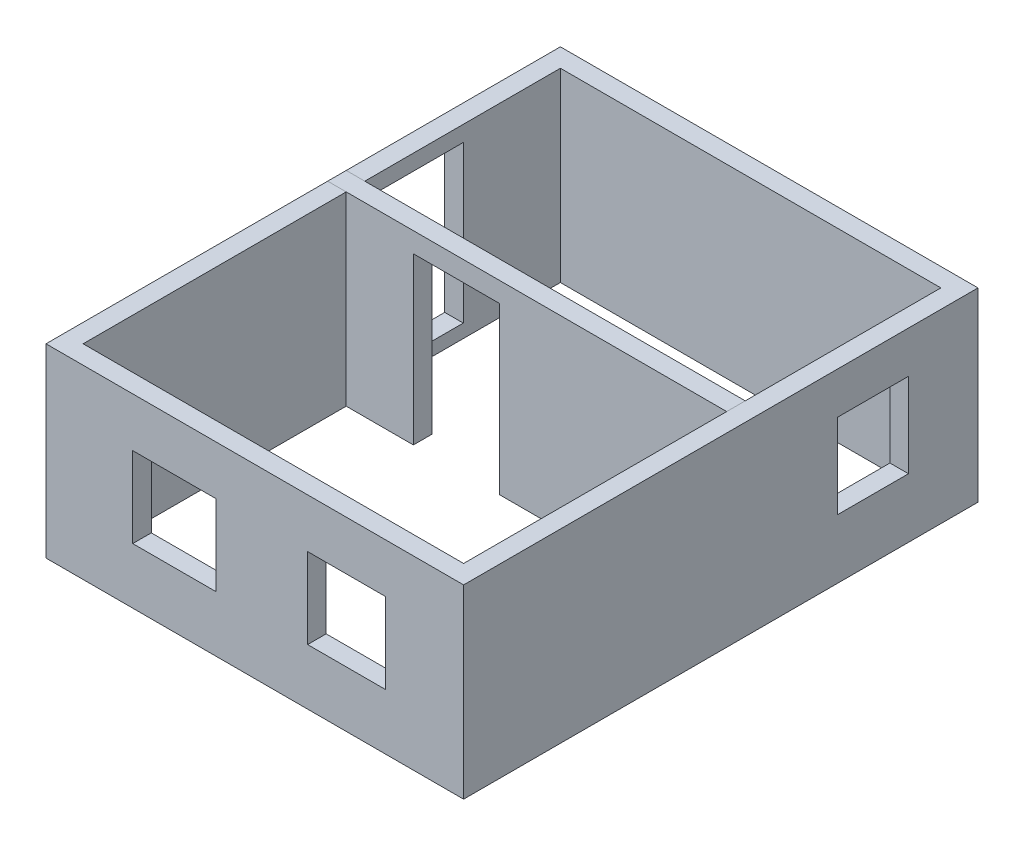
ISO-10303-21;
HEADER;
FILE_DESCRIPTION(('STEP AP214'),'2;1');
FILE_NAME('part.step','',(''),(''),'','','');
FILE_SCHEMA(('AUTOMOTIVE_DESIGN { 1 0 10303 214 1 1 1 1 }'));
ENDSEC;
DATA;
#1=APPLICATION_CONTEXT('core data for automotive mechanical design processes');
#2=APPLICATION_PROTOCOL_DEFINITION('international standard','automotive_design',2000,#1);
#3=PRODUCT_CONTEXT('',#1,'mechanical');
#4=PRODUCT('Part','Part','',(#3));
#5=PRODUCT_RELATED_PRODUCT_CATEGORY('part','',(#4));
#6=PRODUCT_DEFINITION_FORMATION('','',#4);
#7=PRODUCT_DEFINITION_CONTEXT('part definition',#1,'design');
#8=PRODUCT_DEFINITION('design','',#6,#7);
#9=PRODUCT_DEFINITION_SHAPE('','',#8);
#10=(LENGTH_UNIT() NAMED_UNIT(*) SI_UNIT(.MILLI.,.METRE.));
#11=(NAMED_UNIT(*) PLANE_ANGLE_UNIT() SI_UNIT($,.RADIAN.));
#12=(NAMED_UNIT(*) SI_UNIT($,.STERADIAN.) SOLID_ANGLE_UNIT());
#13=UNCERTAINTY_MEASURE_WITH_UNIT(LENGTH_MEASURE(1.E-05),#10,'distance_accuracy_value','');
#14=(GEOMETRIC_REPRESENTATION_CONTEXT(3) GLOBAL_UNCERTAINTY_ASSIGNED_CONTEXT((#13)) GLOBAL_UNIT_ASSIGNED_CONTEXT((#10,
#11,#12)) REPRESENTATION_CONTEXT('',''));
#15=CARTESIAN_POINT('',(0.,0.,0.));
#16=DIRECTION('',(0.,0.,1.));
#17=DIRECTION('',(1.,0.,0.));
#18=AXIS2_PLACEMENT_3D('',#15,#16,#17);
#19=CARTESIAN_POINT('',(4500.,2000.,-5543.));
#20=DIRECTION('',(0.,1.,0.));
#21=DIRECTION('',(0.,0.,1.));
#22=AXIS2_PLACEMENT_3D('',#19,#20,#21);
#23=PLANE('',#22);
#24=DIRECTION('',(0.,0.,-1.));
#25=VECTOR('',#24,1.);
#26=CARTESIAN_POINT('',(4500.,2000.,1.77635683940025E-12));
#27=LINE('',#26,#25);
#28=CARTESIAN_POINT('',(4500.,2000.,1.77635683940025E-12));
#29=VERTEX_POINT('',#28);
#30=CARTESIAN_POINT('',(4500.,2000.,-5543.));
#31=VERTEX_POINT('',#30);
#32=EDGE_CURVE('E394',#29,#31,#27,.T.);
#33=ORIENTED_EDGE('',*,*,#32,.T.);
#34=DIRECTION('',(-1.,0.,0.));
#35=VECTOR('',#34,1.);
#36=CARTESIAN_POINT('',(4500.,2000.,-5543.));
#37=LINE('',#36,#35);
#38=CARTESIAN_POINT('',(0.,2000.,-5543.));
#39=VERTEX_POINT('',#38);
#40=EDGE_CURVE('E397',#31,#39,#37,.T.);
#41=ORIENTED_EDGE('',*,*,#40,.T.);
#42=DIRECTION('',(0.,0.,1.));
#43=VECTOR('',#42,1.);
#44=CARTESIAN_POINT('',(0.,2000.,0.));
#45=LINE('',#44,#43);
#46=CARTESIAN_POINT('',(0.,2000.,0.));
#47=VERTEX_POINT('',#46);
#48=EDGE_CURVE('E400',#39,#47,#45,.T.);
#49=ORIENTED_EDGE('',*,*,#48,.T.);
#50=DIRECTION('',(1.,0.,0.));
#51=VECTOR('',#50,1.);
#52=CARTESIAN_POINT('',(4500.,2000.,1.77635683940025E-12));
#53=LINE('',#52,#51);
#54=EDGE_CURVE('E402',#47,#29,#53,.T.);
#55=ORIENTED_EDGE('',*,*,#54,.T.);
#56=EDGE_LOOP('',(#33,#41,#49,#55));
#57=FACE_BOUND('',#56,.T.);
#58=DIRECTION('',(-1.,0.,0.));
#59=VECTOR('',#58,1.);
#60=CARTESIAN_POINT('',(4500.,2000.,-5343.));
#61=LINE('',#60,#59);
#62=CARTESIAN_POINT('',(4300.,2000.,-5343.));
#63=VERTEX_POINT('',#62);
#64=CARTESIAN_POINT('',(200.,2000.,-5343.));
#65=VERTEX_POINT('',#64);
#66=EDGE_CURVE('E365',#63,#65,#61,.T.);
#67=ORIENTED_EDGE('',*,*,#66,.F.);
#68=DIRECTION('',(0.,0.,-1.));
#69=VECTOR('',#68,1.);
#70=CARTESIAN_POINT('',(4300.,2000.,1.77635683940025E-12));
#71=LINE('',#70,#69);
#72=CARTESIAN_POINT('',(4300.,2000.,-199.999999999998));
#73=VERTEX_POINT('',#72);
#74=EDGE_CURVE('E363',#73,#63,#71,.T.);
#75=ORIENTED_EDGE('',*,*,#74,.F.);
#76=DIRECTION('',(1.,0.,0.));
#77=VECTOR('',#76,1.);
#78=CARTESIAN_POINT('',(4500.,2000.,-199.999999999998));
#79=LINE('',#78,#77);
#80=CARTESIAN_POINT('',(199.999999999999,2000.,-200.));
#81=VERTEX_POINT('',#80);
#82=EDGE_CURVE('E371',#81,#73,#79,.T.);
#83=ORIENTED_EDGE('',*,*,#82,.F.);
#84=DIRECTION('',(0.,0.,1.));
#85=VECTOR('',#84,1.);
#86=CARTESIAN_POINT('',(200.,2000.,0.));
#87=LINE('',#86,#85);
#88=EDGE_CURVE('E368',#65,#81,#87,.T.);
#89=ORIENTED_EDGE('',*,*,#88,.F.);
#90=EDGE_LOOP('',(#67,#75,#83,#89));
#91=FACE_BOUND('',#90,.T.);
#92=ADVANCED_FACE('F68',(#57,#91),#23,.T.);
#93=CARTESIAN_POINT('',(4500.,0.,-5543.));
#94=DIRECTION('',(0.,1.,0.));
#95=DIRECTION('',(0.,0.,1.));
#96=AXIS2_PLACEMENT_3D('',#93,#94,#95);
#97=PLANE('',#96);
#98=DIRECTION('',(0.,0.,-1.));
#99=VECTOR('',#98,1.);
#100=CARTESIAN_POINT('',(4500.,0.,1.77635683940025E-12));
#101=LINE('',#100,#99);
#102=CARTESIAN_POINT('',(4500.,0.,1.77635683940025E-12));
#103=VERTEX_POINT('',#102);
#104=CARTESIAN_POINT('',(4500.,0.,-5543.));
#105=VERTEX_POINT('',#104);
#106=EDGE_CURVE('E393',#103,#105,#101,.T.);
#107=ORIENTED_EDGE('',*,*,#106,.F.);
#108=DIRECTION('',(1.,0.,0.));
#109=VECTOR('',#108,1.);
#110=CARTESIAN_POINT('',(4500.,0.,1.77635683940025E-12));
#111=LINE('',#110,#109);
#112=CARTESIAN_POINT('',(0.,0.,0.));
#113=VERTEX_POINT('',#112);
#114=EDGE_CURVE('E398',#113,#103,#111,.T.);
#115=ORIENTED_EDGE('',*,*,#114,.F.);
#116=DIRECTION('',(0.,0.,1.));
#117=VECTOR('',#116,1.);
#118=CARTESIAN_POINT('',(0.,0.,0.));
#119=LINE('',#118,#117);
#120=CARTESIAN_POINT('',(0.,0.,-5543.));
#121=VERTEX_POINT('',#120);
#122=EDGE_CURVE('E409',#121,#113,#119,.T.);
#123=ORIENTED_EDGE('',*,*,#122,.F.);
#124=DIRECTION('',(-1.,0.,0.));
#125=VECTOR('',#124,1.);
#126=CARTESIAN_POINT('',(4500.,0.,-5543.));
#127=LINE('',#126,#125);
#128=EDGE_CURVE('E407',#105,#121,#127,.T.);
#129=ORIENTED_EDGE('',*,*,#128,.F.);
#130=EDGE_LOOP('',(#107,#115,#123,#129));
#131=FACE_BOUND('',#130,.T.);
#132=DIRECTION('',(0.,0.,-1.));
#133=VECTOR('',#132,1.);
#134=CARTESIAN_POINT('',(4300.,0.,1.77635683940025E-12));
#135=LINE('',#134,#133);
#136=CARTESIAN_POINT('',(4300.,0.,-199.999999999998));
#137=VERTEX_POINT('',#136);
#138=CARTESIAN_POINT('',(4300.,0.,-5343.));
#139=VERTEX_POINT('',#138);
#140=EDGE_CURVE('E362',#137,#139,#135,.T.);
#141=ORIENTED_EDGE('',*,*,#140,.T.);
#142=DIRECTION('',(-1.,0.,0.));
#143=VECTOR('',#142,1.);
#144=CARTESIAN_POINT('',(4500.,0.,-5343.));
#145=LINE('',#144,#143);
#146=CARTESIAN_POINT('',(200.,0.,-5343.));
#147=VERTEX_POINT('',#146);
#148=EDGE_CURVE('E376',#139,#147,#145,.T.);
#149=ORIENTED_EDGE('',*,*,#148,.T.);
#150=DIRECTION('',(0.,0.,1.));
#151=VECTOR('',#150,1.);
#152=CARTESIAN_POINT('',(200.,0.,0.));
#153=LINE('',#152,#151);
#154=CARTESIAN_POINT('',(200.,0.,-200.));
#155=VERTEX_POINT('',#154);
#156=EDGE_CURVE('E379',#147,#155,#153,.T.);
#157=ORIENTED_EDGE('',*,*,#156,.T.);
#158=DIRECTION('',(1.,0.,0.));
#159=VECTOR('',#158,1.);
#160=CARTESIAN_POINT('',(4500.,0.,-199.999999999998));
#161=LINE('',#160,#159);
#162=EDGE_CURVE('E366',#155,#137,#161,.T.);
#163=ORIENTED_EDGE('',*,*,#162,.T.);
#164=EDGE_LOOP('',(#141,#149,#157,#163));
#165=FACE_BOUND('',#164,.T.);
#166=ADVANCED_FACE('F427',(#131,#165),#97,.F.);
#167=CARTESIAN_POINT('',(4500.,2000.,1.77635683940025E-12));
#168=DIRECTION('',(-1.,0.,0.));
#169=DIRECTION('',(0.,0.,1.));
#170=AXIS2_PLACEMENT_3D('',#167,#168,#169);
#171=PLANE('',#170);
#172=DIRECTION('',(0.,1.,0.));
#173=VECTOR('',#172,1.);
#174=CARTESIAN_POINT('',(4500.,1549.68703188642,-4793.88240825894));
#175=LINE('',#174,#173);
#176=CARTESIAN_POINT('',(4500.,640.341483998576,-4793.88240825894));
#177=VERTEX_POINT('',#176);
#178=CARTESIAN_POINT('',(4500.,1549.68703188642,-4793.88240825894));
#179=VERTEX_POINT('',#178);
#180=EDGE_CURVE('E270',#177,#179,#175,.T.);
#181=ORIENTED_EDGE('',*,*,#180,.F.);
#182=DIRECTION('',(0.,0.,-1.));
#183=VECTOR('',#182,1.);
#184=CARTESIAN_POINT('',(4500.,640.341483998576,-4026.96447630534));
#185=LINE('',#184,#183);
#186=CARTESIAN_POINT('',(4500.,640.341483998576,-4026.96447630534));
#187=VERTEX_POINT('',#186);
#188=EDGE_CURVE('E273',#187,#177,#185,.T.);
#189=ORIENTED_EDGE('',*,*,#188,.F.);
#190=DIRECTION('',(0.,-1.,0.));
#191=VECTOR('',#190,1.);
#192=CARTESIAN_POINT('',(4500.,1549.68703188642,-4026.96447630534));
#193=LINE('',#192,#191);
#194=CARTESIAN_POINT('',(4500.,1549.68703188642,-4026.96447630534));
#195=VERTEX_POINT('',#194);
#196=EDGE_CURVE('E266',#195,#187,#193,.T.);
#197=ORIENTED_EDGE('',*,*,#196,.F.);
#198=DIRECTION('',(0.,0.,1.));
#199=VECTOR('',#198,1.);
#200=CARTESIAN_POINT('',(4500.,1549.68703188642,-4026.96447630534));
#201=LINE('',#200,#199);
#202=EDGE_CURVE('E267',#179,#195,#201,.T.);
#203=ORIENTED_EDGE('',*,*,#202,.F.);
#204=EDGE_LOOP('',(#181,#189,#197,#203));
#205=FACE_BOUND('',#204,.T.);
#206=ORIENTED_EDGE('',*,*,#106,.T.);
#207=DIRECTION('',(0.,-1.,0.));
#208=VECTOR('',#207,1.);
#209=CARTESIAN_POINT('',(4500.,2000.,-5543.));
#210=LINE('',#209,#208);
#211=EDGE_CURVE('E13',#31,#105,#210,.T.);
#212=ORIENTED_EDGE('',*,*,#211,.F.);
#213=ORIENTED_EDGE('',*,*,#32,.F.);
#214=DIRECTION('',(0.,-1.,0.));
#215=VECTOR('',#214,1.);
#216=CARTESIAN_POINT('',(4500.,2000.,1.77635683940025E-12));
#217=LINE('',#216,#215);
#218=EDGE_CURVE('E404',#29,#103,#217,.T.);
#219=ORIENTED_EDGE('',*,*,#218,.T.);
#220=EDGE_LOOP('',(#206,#212,#213,#219));
#221=FACE_BOUND('',#220,.T.);
#222=ADVANCED_FACE('F70',(#205,#221),#171,.F.);
#223=CARTESIAN_POINT('',(4500.,2000.,-5543.));
#224=DIRECTION('',(0.,0.,1.));
#225=DIRECTION('',(1.,0.,0.));
#226=AXIS2_PLACEMENT_3D('',#223,#224,#225);
#227=PLANE('',#226);
#228=ORIENTED_EDGE('',*,*,#128,.T.);
#229=DIRECTION('',(0.,-1.,0.));
#230=VECTOR('',#229,1.);
#231=CARTESIAN_POINT('',(0.,2000.,-5543.));
#232=LINE('',#231,#230);
#233=EDGE_CURVE('E76',#39,#121,#232,.T.);
#234=ORIENTED_EDGE('',*,*,#233,.F.);
#235=ORIENTED_EDGE('',*,*,#40,.F.);
#236=ORIENTED_EDGE('',*,*,#211,.T.);
#237=EDGE_LOOP('',(#228,#234,#235,#236));
#238=FACE_BOUND('',#237,.T.);
#239=ADVANCED_FACE('F438',(#238),#227,.F.);
#240=CARTESIAN_POINT('',(0.,2000.,0.));
#241=DIRECTION('',(1.,0.,0.));
#242=DIRECTION('',(0.,0.,-1.));
#243=AXIS2_PLACEMENT_3D('',#240,#241,#242);
#244=PLANE('',#243);
#245=DIRECTION('',(0.,1.,0.));
#246=VECTOR('',#245,1.);
#247=CARTESIAN_POINT('',(0.,1830.68470668906,-3365.89023000623));
#248=LINE('',#247,#246);
#249=CARTESIAN_POINT('',(0.,144.955037982848,-3365.89023000623));
#250=VERTEX_POINT('',#249);
#251=CARTESIAN_POINT('',(0.,1830.68470668906,-3365.89023000623));
#252=VERTEX_POINT('',#251);
#253=EDGE_CURVE('E253',#250,#252,#248,.T.);
#254=ORIENTED_EDGE('',*,*,#253,.F.);
#255=DIRECTION('',(0.,0.,1.));
#256=VECTOR('',#255,1.);
#257=CARTESIAN_POINT('',(0.,144.955037982848,-4296.45198354059));
#258=LINE('',#257,#256);
#259=CARTESIAN_POINT('',(0.,144.955037982848,-4296.45198354059));
#260=VERTEX_POINT('',#259);
#261=EDGE_CURVE('E246',#260,#250,#258,.T.);
#262=ORIENTED_EDGE('',*,*,#261,.F.);
#263=DIRECTION('',(0.,-1.,0.));
#264=VECTOR('',#263,1.);
#265=CARTESIAN_POINT('',(0.,1830.68470668906,-4296.45198354059));
#266=LINE('',#265,#264);
#267=CARTESIAN_POINT('',(0.,1830.68470668906,-4296.45198354059));
#268=VERTEX_POINT('',#267);
#269=EDGE_CURVE('E257',#268,#260,#266,.T.);
#270=ORIENTED_EDGE('',*,*,#269,.F.);
#271=DIRECTION('',(0.,0.,-1.));
#272=VECTOR('',#271,1.);
#273=CARTESIAN_POINT('',(0.,1830.68470668906,-4296.45198354059));
#274=LINE('',#273,#272);
#275=EDGE_CURVE('E83',#252,#268,#274,.T.);
#276=ORIENTED_EDGE('',*,*,#275,.F.);
#277=EDGE_LOOP('',(#254,#262,#270,#276));
#278=FACE_BOUND('',#277,.T.);
#279=ORIENTED_EDGE('',*,*,#122,.T.);
#280=DIRECTION('',(0.,-1.,0.));
#281=VECTOR('',#280,1.);
#282=CARTESIAN_POINT('',(0.,2000.,0.));
#283=LINE('',#282,#281);
#284=EDGE_CURVE('E414',#47,#113,#283,.T.);
#285=ORIENTED_EDGE('',*,*,#284,.F.);
#286=ORIENTED_EDGE('',*,*,#48,.F.);
#287=ORIENTED_EDGE('',*,*,#233,.T.);
#288=EDGE_LOOP('',(#279,#285,#286,#287));
#289=FACE_BOUND('',#288,.T.);
#290=ADVANCED_FACE('F421',(#278,#289),#244,.F.);
#291=CARTESIAN_POINT('',(4500.,2000.,1.77635683940025E-12));
#292=DIRECTION('',(0.,0.,-1.));
#293=DIRECTION('',(-1.,0.,0.));
#294=AXIS2_PLACEMENT_3D('',#291,#292,#293);
#295=PLANE('',#294);
#296=DIRECTION('',(0.,1.,0.));
#297=VECTOR('',#296,1.);
#298=CARTESIAN_POINT('',(3659.79972418191,1470.46468477926,0.));
#299=LINE('',#298,#297);
#300=CARTESIAN_POINT('',(3659.79972418191,602.701516519347,0.));
#301=VERTEX_POINT('',#300);
#302=CARTESIAN_POINT('',(3659.79972418191,1470.46468477926,0.));
#303=VERTEX_POINT('',#302);
#304=EDGE_CURVE('E302',#301,#303,#299,.T.);
#305=ORIENTED_EDGE('',*,*,#304,.F.);
#306=DIRECTION('',(1.,0.,0.));
#307=VECTOR('',#306,1.);
#308=CARTESIAN_POINT('',(2819.15415493012,602.701516519347,0.));
#309=LINE('',#308,#307);
#310=CARTESIAN_POINT('',(2819.15415493012,602.701516519347,0.));
#311=VERTEX_POINT('',#310);
#312=EDGE_CURVE('E305',#311,#301,#309,.T.);
#313=ORIENTED_EDGE('',*,*,#312,.F.);
#314=DIRECTION('',(0.,-1.,0.));
#315=VECTOR('',#314,1.);
#316=CARTESIAN_POINT('',(2819.15415493012,1470.46468477926,0.));
#317=LINE('',#316,#315);
#318=CARTESIAN_POINT('',(2819.15415493012,1470.46468477926,1.11284972542972E-12));
#319=VERTEX_POINT('',#318);
#320=EDGE_CURVE('E298',#319,#311,#317,.T.);
#321=ORIENTED_EDGE('',*,*,#320,.F.);
#322=DIRECTION('',(-1.,0.,0.));
#323=VECTOR('',#322,1.);
#324=CARTESIAN_POINT('',(2819.15415493012,1470.46468477926,0.));
#325=LINE('',#324,#323);
#326=EDGE_CURVE('E299',#303,#319,#325,.T.);
#327=ORIENTED_EDGE('',*,*,#326,.F.);
#328=EDGE_LOOP('',(#305,#313,#321,#327));
#329=FACE_BOUND('',#328,.T.);
#330=DIRECTION('',(0.,1.,0.));
#331=VECTOR('',#330,1.);
#332=CARTESIAN_POINT('',(1829.36179113365,1470.46468477926,0.));
#333=LINE('',#332,#331);
#334=CARTESIAN_POINT('',(1829.36179113365,602.701516519347,0.));
#335=VERTEX_POINT('',#334);
#336=CARTESIAN_POINT('',(1829.36179113365,1470.46468477926,0.));
#337=VERTEX_POINT('',#336);
#338=EDGE_CURVE('E334',#335,#337,#333,.T.);
#339=ORIENTED_EDGE('',*,*,#338,.F.);
#340=DIRECTION('',(1.,0.,0.));
#341=VECTOR('',#340,1.);
#342=CARTESIAN_POINT('',(934.481023865607,602.701516519347,0.));
#343=LINE('',#342,#341);
#344=CARTESIAN_POINT('',(934.481023865607,602.701516519347,0.));
#345=VERTEX_POINT('',#344);
#346=EDGE_CURVE('E337',#345,#335,#343,.T.);
#347=ORIENTED_EDGE('',*,*,#346,.F.);
#348=DIRECTION('',(0.,-1.,0.));
#349=VECTOR('',#348,1.);
#350=CARTESIAN_POINT('',(934.481023865607,1470.46468477926,0.));
#351=LINE('',#350,#349);
#352=CARTESIAN_POINT('',(934.481023865607,1470.46468477926,3.68882612896316E-13));
#353=VERTEX_POINT('',#352);
#354=EDGE_CURVE('E330',#353,#345,#351,.T.);
#355=ORIENTED_EDGE('',*,*,#354,.F.);
#356=DIRECTION('',(-1.,0.,0.));
#357=VECTOR('',#356,1.);
#358=CARTESIAN_POINT('',(934.481023865607,1470.46468477926,0.));
#359=LINE('',#358,#357);
#360=EDGE_CURVE('E331',#337,#353,#359,.T.);
#361=ORIENTED_EDGE('',*,*,#360,.F.);
#362=EDGE_LOOP('',(#339,#347,#355,#361));
#363=FACE_BOUND('',#362,.T.);
#364=ORIENTED_EDGE('',*,*,#114,.T.);
#365=ORIENTED_EDGE('',*,*,#218,.F.);
#366=ORIENTED_EDGE('',*,*,#54,.F.);
#367=ORIENTED_EDGE('',*,*,#284,.T.);
#368=EDGE_LOOP('',(#364,#365,#366,#367));
#369=FACE_BOUND('',#368,.T.);
#370=ADVANCED_FACE('F431',(#329,#363,#369),#295,.F.);
#371=CARTESIAN_POINT('',(4300.,2000.,1.77635683940025E-12));
#372=DIRECTION('',(-1.,0.,0.));
#373=DIRECTION('',(0.,0.,1.));
#374=AXIS2_PLACEMENT_3D('',#371,#372,#373);
#375=PLANE('',#374);
#376=DIRECTION('',(0.,0.,-1.));
#377=VECTOR('',#376,1.);
#378=CARTESIAN_POINT('',(4300.,640.341483998576,-4026.96447630534));
#379=LINE('',#378,#377);
#380=CARTESIAN_POINT('',(4300.,640.341483998576,-4026.96447630534));
#381=VERTEX_POINT('',#380);
#382=CARTESIAN_POINT('',(4300.,640.341483998576,-4793.88240825894));
#383=VERTEX_POINT('',#382);
#384=EDGE_CURVE('E269',#381,#383,#379,.T.);
#385=ORIENTED_EDGE('',*,*,#384,.T.);
#386=DIRECTION('',(0.,1.,0.));
#387=VECTOR('',#386,1.);
#388=CARTESIAN_POINT('',(4300.,1549.68703188642,-4793.88240825894));
#389=LINE('',#388,#387);
#390=CARTESIAN_POINT('',(4300.,1549.68703188642,-4793.88240825894));
#391=VERTEX_POINT('',#390);
#392=EDGE_CURVE('E290',#383,#391,#389,.T.);
#393=ORIENTED_EDGE('',*,*,#392,.T.);
#394=DIRECTION('',(0.,0.,1.));
#395=VECTOR('',#394,1.);
#396=CARTESIAN_POINT('',(4300.,1549.68703188642,-4026.96447630534));
#397=LINE('',#396,#395);
#398=CARTESIAN_POINT('',(4300.,1549.68703188642,-4026.96447630534));
#399=VERTEX_POINT('',#398);
#400=EDGE_CURVE('E286',#391,#399,#397,.T.);
#401=ORIENTED_EDGE('',*,*,#400,.T.);
#402=DIRECTION('',(0.,-1.,0.));
#403=VECTOR('',#402,1.);
#404=CARTESIAN_POINT('',(4300.,1549.68703188642,-4026.96447630534));
#405=LINE('',#404,#403);
#406=EDGE_CURVE('E281',#399,#381,#405,.T.);
#407=ORIENTED_EDGE('',*,*,#406,.T.);
#408=EDGE_LOOP('',(#385,#393,#401,#407));
#409=FACE_BOUND('',#408,.T.);
#410=ORIENTED_EDGE('',*,*,#140,.F.);
#411=DIRECTION('',(0.,-1.,0.));
#412=VECTOR('',#411,1.);
#413=CARTESIAN_POINT('',(4300.,2000.,-199.999999999998));
#414=LINE('',#413,#412);
#415=EDGE_CURVE('E373',#73,#137,#414,.T.);
#416=ORIENTED_EDGE('',*,*,#415,.F.);
#417=ORIENTED_EDGE('',*,*,#74,.T.);
#418=DIRECTION('',(0.,-1.,0.));
#419=VECTOR('',#418,1.);
#420=CARTESIAN_POINT('',(4300.,2000.,-5343.));
#421=LINE('',#420,#419);
#422=EDGE_CURVE('E390',#63,#139,#421,.T.);
#423=ORIENTED_EDGE('',*,*,#422,.T.);
#424=EDGE_LOOP('',(#410,#416,#417,#423));
#425=FACE_BOUND('',#424,.T.);
#426=ADVANCED_FACE('F454',(#409,#425),#375,.T.);
#427=CARTESIAN_POINT('',(4500.,2000.,-5343.));
#428=DIRECTION('',(0.,0.,1.));
#429=DIRECTION('',(1.,0.,0.));
#430=AXIS2_PLACEMENT_3D('',#427,#428,#429);
#431=PLANE('',#430);
#432=ORIENTED_EDGE('',*,*,#148,.F.);
#433=ORIENTED_EDGE('',*,*,#422,.F.);
#434=ORIENTED_EDGE('',*,*,#66,.T.);
#435=DIRECTION('',(0.,-1.,0.));
#436=VECTOR('',#435,1.);
#437=CARTESIAN_POINT('',(200.,2000.,-5343.));
#438=LINE('',#437,#436);
#439=EDGE_CURVE('E388',#65,#147,#438,.T.);
#440=ORIENTED_EDGE('',*,*,#439,.T.);
#441=EDGE_LOOP('',(#432,#433,#434,#440));
#442=FACE_BOUND('',#441,.T.);
#443=ADVANCED_FACE('F462',(#442),#431,.T.);
#444=CARTESIAN_POINT('',(200.,2000.,0.));
#445=DIRECTION('',(1.,0.,0.));
#446=DIRECTION('',(0.,0.,-1.));
#447=AXIS2_PLACEMENT_3D('',#444,#445,#446);
#448=PLANE('',#447);
#449=DIRECTION('',(0.,0.,1.));
#450=VECTOR('',#449,1.);
#451=CARTESIAN_POINT('',(200.,144.955037982848,-4296.45198354059));
#452=LINE('',#451,#450);
#453=CARTESIAN_POINT('',(200.,144.955037982847,-4296.45198354059));
#454=VERTEX_POINT('',#453);
#455=CARTESIAN_POINT('',(200.,144.955037982848,-3365.89023000623));
#456=VERTEX_POINT('',#455);
#457=EDGE_CURVE('E243',#454,#456,#452,.T.);
#458=ORIENTED_EDGE('',*,*,#457,.T.);
#459=DIRECTION('',(0.,1.,0.));
#460=VECTOR('',#459,1.);
#461=CARTESIAN_POINT('',(200.,1830.68470668906,-3365.89023000623));
#462=LINE('',#461,#460);
#463=CARTESIAN_POINT('',(200.,1830.68470668906,-3365.89023000623));
#464=VERTEX_POINT('',#463);
#465=EDGE_CURVE('E230',#456,#464,#462,.T.);
#466=ORIENTED_EDGE('',*,*,#465,.T.);
#467=DIRECTION('',(0.,0.,-1.));
#468=VECTOR('',#467,1.);
#469=CARTESIAN_POINT('',(200.,1830.68470668906,-4296.45198354059));
#470=LINE('',#469,#468);
#471=CARTESIAN_POINT('',(200.,1830.68470668906,-4296.45198354059));
#472=VERTEX_POINT('',#471);
#473=EDGE_CURVE('E261',#464,#472,#470,.T.);
#474=ORIENTED_EDGE('',*,*,#473,.T.);
#475=DIRECTION('',(0.,-1.,0.));
#476=VECTOR('',#475,1.);
#477=CARTESIAN_POINT('',(200.,1830.68470668906,-4296.45198354059));
#478=LINE('',#477,#476);
#479=EDGE_CURVE('E251',#472,#454,#478,.T.);
#480=ORIENTED_EDGE('',*,*,#479,.T.);
#481=EDGE_LOOP('',(#458,#466,#474,#480));
#482=FACE_BOUND('',#481,.T.);
#483=ORIENTED_EDGE('',*,*,#156,.F.);
#484=ORIENTED_EDGE('',*,*,#439,.F.);
#485=ORIENTED_EDGE('',*,*,#88,.T.);
#486=DIRECTION('',(0.,-1.,0.));
#487=VECTOR('',#486,1.);
#488=CARTESIAN_POINT('',(200.,2000.,-200.));
#489=LINE('',#488,#487);
#490=EDGE_CURVE('E386',#81,#155,#489,.T.);
#491=ORIENTED_EDGE('',*,*,#490,.T.);
#492=EDGE_LOOP('',(#483,#484,#485,#491));
#493=FACE_BOUND('',#492,.T.);
#494=ADVANCED_FACE('F249',(#482,#493),#448,.T.);
#495=CARTESIAN_POINT('',(4500.,2000.,-199.999999999998));
#496=DIRECTION('',(0.,0.,-1.));
#497=DIRECTION('',(-1.,0.,0.));
#498=AXIS2_PLACEMENT_3D('',#495,#496,#497);
#499=PLANE('',#498);
#500=DIRECTION('',(1.,0.,0.));
#501=VECTOR('',#500,1.);
#502=CARTESIAN_POINT('',(2819.15415493011,602.701516519347,-199.999999999999));
#503=LINE('',#502,#501);
#504=CARTESIAN_POINT('',(2819.15415493012,602.701516519347,-199.999999999999));
#505=VERTEX_POINT('',#504);
#506=CARTESIAN_POINT('',(3659.79972418191,602.701516519347,-199.999999999999));
#507=VERTEX_POINT('',#506);
#508=EDGE_CURVE('E301',#505,#507,#503,.T.);
#509=ORIENTED_EDGE('',*,*,#508,.T.);
#510=DIRECTION('',(0.,1.,0.));
#511=VECTOR('',#510,1.);
#512=CARTESIAN_POINT('',(3659.79972418191,1470.46468477926,-199.999999999998));
#513=LINE('',#512,#511);
#514=CARTESIAN_POINT('',(3659.79972418191,1470.46468477926,-199.999999999998));
#515=VERTEX_POINT('',#514);
#516=EDGE_CURVE('E322',#507,#515,#513,.T.);
#517=ORIENTED_EDGE('',*,*,#516,.T.);
#518=DIRECTION('',(-1.,0.,0.));
#519=VECTOR('',#518,1.);
#520=CARTESIAN_POINT('',(2819.15415493011,1470.46468477926,-199.999999999999));
#521=LINE('',#520,#519);
#522=CARTESIAN_POINT('',(2819.15415493012,1470.46468477926,-199.999999999999));
#523=VERTEX_POINT('',#522);
#524=EDGE_CURVE('E318',#515,#523,#521,.T.);
#525=ORIENTED_EDGE('',*,*,#524,.T.);
#526=DIRECTION('',(0.,-1.,0.));
#527=VECTOR('',#526,1.);
#528=CARTESIAN_POINT('',(2819.15415493012,1470.46468477926,-199.999999999999));
#529=LINE('',#528,#527);
#530=EDGE_CURVE('E313',#523,#505,#529,.T.);
#531=ORIENTED_EDGE('',*,*,#530,.T.);
#532=EDGE_LOOP('',(#509,#517,#525,#531));
#533=FACE_BOUND('',#532,.T.);
#534=DIRECTION('',(1.,0.,0.));
#535=VECTOR('',#534,1.);
#536=CARTESIAN_POINT('',(934.481023865607,602.701516519347,-200.));
#537=LINE('',#536,#535);
#538=CARTESIAN_POINT('',(934.481023865607,602.701516519347,-200.));
#539=VERTEX_POINT('',#538);
#540=CARTESIAN_POINT('',(1829.36179113365,602.701516519347,-199.999999999999));
#541=VERTEX_POINT('',#540);
#542=EDGE_CURVE('E333',#539,#541,#537,.T.);
#543=ORIENTED_EDGE('',*,*,#542,.T.);
#544=DIRECTION('',(0.,1.,0.));
#545=VECTOR('',#544,1.);
#546=CARTESIAN_POINT('',(1829.36179113365,1470.46468477926,-199.999999999999));
#547=LINE('',#546,#545);
#548=CARTESIAN_POINT('',(1829.36179113365,1470.46468477926,-199.999999999999));
#549=VERTEX_POINT('',#548);
#550=EDGE_CURVE('E354',#541,#549,#547,.T.);
#551=ORIENTED_EDGE('',*,*,#550,.T.);
#552=DIRECTION('',(-1.,0.,0.));
#553=VECTOR('',#552,1.);
#554=CARTESIAN_POINT('',(934.481023865607,1470.46468477926,-200.));
#555=LINE('',#554,#553);
#556=CARTESIAN_POINT('',(934.481023865607,1470.46468477926,-200.));
#557=VERTEX_POINT('',#556);
#558=EDGE_CURVE('E350',#549,#557,#555,.T.);
#559=ORIENTED_EDGE('',*,*,#558,.T.);
#560=DIRECTION('',(0.,-1.,0.));
#561=VECTOR('',#560,1.);
#562=CARTESIAN_POINT('',(934.481023865607,1470.46468477926,-200.));
#563=LINE('',#562,#561);
#564=EDGE_CURVE('E345',#557,#539,#563,.T.);
#565=ORIENTED_EDGE('',*,*,#564,.T.);
#566=EDGE_LOOP('',(#543,#551,#559,#565));
#567=FACE_BOUND('',#566,.T.);
#568=ORIENTED_EDGE('',*,*,#162,.F.);
#569=ORIENTED_EDGE('',*,*,#490,.F.);
#570=ORIENTED_EDGE('',*,*,#82,.T.);
#571=ORIENTED_EDGE('',*,*,#415,.T.);
#572=EDGE_LOOP('',(#568,#569,#570,#571));
#573=FACE_BOUND('',#572,.T.);
#574=ADVANCED_FACE('F485',(#533,#567,#573),#499,.T.);
#575=CARTESIAN_POINT('',(934.481023865607,602.701516519347,-1446.52497119581));
#576=DIRECTION('',(0.,-1.,0.));
#577=DIRECTION('',(0.,0.,-1.));
#578=AXIS2_PLACEMENT_3D('',#575,#576,#577);
#579=PLANE('',#578);
#580=DIRECTION('',(0.,0.,1.));
#581=VECTOR('',#580,1.);
#582=CARTESIAN_POINT('',(934.481023865607,602.701516519347,-1446.52497119581));
#583=LINE('',#582,#581);
#584=EDGE_CURVE('E348',#539,#345,#583,.T.);
#585=ORIENTED_EDGE('',*,*,#584,.T.);
#586=ORIENTED_EDGE('',*,*,#346,.T.);
#587=DIRECTION('',(0.,0.,1.));
#588=VECTOR('',#587,1.);
#589=CARTESIAN_POINT('',(1829.36179113365,602.701516519347,-1446.52497119581));
#590=LINE('',#589,#588);
#591=EDGE_CURVE('E344',#541,#335,#590,.T.);
#592=ORIENTED_EDGE('',*,*,#591,.F.);
#593=ORIENTED_EDGE('',*,*,#542,.F.);
#594=EDGE_LOOP('',(#585,#586,#592,#593));
#595=FACE_BOUND('',#594,.T.);
#596=ADVANCED_FACE('F478',(#595),#579,.F.);
#597=CARTESIAN_POINT('',(1829.36179113365,1470.46468477926,-1446.52497119581));
#598=DIRECTION('',(1.,0.,0.));
#599=DIRECTION('',(0.,0.,-1.));
#600=AXIS2_PLACEMENT_3D('',#597,#598,#599);
#601=PLANE('',#600);
#602=ORIENTED_EDGE('',*,*,#591,.T.);
#603=ORIENTED_EDGE('',*,*,#338,.T.);
#604=DIRECTION('',(0.,0.,1.));
#605=VECTOR('',#604,1.);
#606=CARTESIAN_POINT('',(1829.36179113365,1470.46468477926,-1446.52497119581));
#607=LINE('',#606,#605);
#608=EDGE_CURVE('E353',#549,#337,#607,.T.);
#609=ORIENTED_EDGE('',*,*,#608,.F.);
#610=ORIENTED_EDGE('',*,*,#550,.F.);
#611=EDGE_LOOP('',(#602,#603,#609,#610));
#612=FACE_BOUND('',#611,.T.);
#613=ADVANCED_FACE('F474',(#612),#601,.F.);
#614=CARTESIAN_POINT('',(934.481023865607,1470.46468477926,-1446.52497119581));
#615=DIRECTION('',(0.,1.,0.));
#616=DIRECTION('',(0.,0.,1.));
#617=AXIS2_PLACEMENT_3D('',#614,#615,#616);
#618=PLANE('',#617);
#619=ORIENTED_EDGE('',*,*,#608,.T.);
#620=ORIENTED_EDGE('',*,*,#360,.T.);
#621=DIRECTION('',(0.,0.,1.));
#622=VECTOR('',#621,1.);
#623=CARTESIAN_POINT('',(934.481023865607,1470.46468477926,-1446.52497119581));
#624=LINE('',#623,#622);
#625=EDGE_CURVE('E349',#557,#353,#624,.T.);
#626=ORIENTED_EDGE('',*,*,#625,.F.);
#627=ORIENTED_EDGE('',*,*,#558,.F.);
#628=EDGE_LOOP('',(#619,#620,#626,#627));
#629=FACE_BOUND('',#628,.T.);
#630=ADVANCED_FACE('F483',(#629),#618,.F.);
#631=CARTESIAN_POINT('',(934.481023865607,1470.46468477926,-1446.52497119581));
#632=DIRECTION('',(-1.,0.,0.));
#633=DIRECTION('',(0.,0.,1.));
#634=AXIS2_PLACEMENT_3D('',#631,#632,#633);
#635=PLANE('',#634);
#636=ORIENTED_EDGE('',*,*,#625,.T.);
#637=ORIENTED_EDGE('',*,*,#354,.T.);
#638=ORIENTED_EDGE('',*,*,#584,.F.);
#639=ORIENTED_EDGE('',*,*,#564,.F.);
#640=EDGE_LOOP('',(#636,#637,#638,#639));
#641=FACE_BOUND('',#640,.T.);
#642=ADVANCED_FACE('F480',(#641),#635,.F.);
#643=CARTESIAN_POINT('',(2819.15415493012,602.701516519347,-1446.52497119581));
#644=DIRECTION('',(0.,-1.,0.));
#645=DIRECTION('',(0.,0.,-1.));
#646=AXIS2_PLACEMENT_3D('',#643,#644,#645);
#647=PLANE('',#646);
#648=DIRECTION('',(0.,0.,1.));
#649=VECTOR('',#648,1.);
#650=CARTESIAN_POINT('',(2819.15415493012,602.701516519347,-1446.52497119581));
#651=LINE('',#650,#649);
#652=EDGE_CURVE('E316',#505,#311,#651,.T.);
#653=ORIENTED_EDGE('',*,*,#652,.T.);
#654=ORIENTED_EDGE('',*,*,#312,.T.);
#655=DIRECTION('',(0.,0.,1.));
#656=VECTOR('',#655,1.);
#657=CARTESIAN_POINT('',(3659.79972418191,602.701516519347,-1446.52497119581));
#658=LINE('',#657,#656);
#659=EDGE_CURVE('E312',#507,#301,#658,.T.);
#660=ORIENTED_EDGE('',*,*,#659,.F.);
#661=ORIENTED_EDGE('',*,*,#508,.F.);
#662=EDGE_LOOP('',(#653,#654,#660,#661));
#663=FACE_BOUND('',#662,.T.);
#664=ADVANCED_FACE('F515',(#663),#647,.F.);
#665=CARTESIAN_POINT('',(3659.79972418191,1470.46468477926,-1446.52497119581));
#666=DIRECTION('',(1.,0.,0.));
#667=DIRECTION('',(0.,0.,-1.));
#668=AXIS2_PLACEMENT_3D('',#665,#666,#667);
#669=PLANE('',#668);
#670=ORIENTED_EDGE('',*,*,#659,.T.);
#671=ORIENTED_EDGE('',*,*,#304,.T.);
#672=DIRECTION('',(0.,0.,1.));
#673=VECTOR('',#672,1.);
#674=CARTESIAN_POINT('',(3659.79972418191,1470.46468477926,-1446.52497119581));
#675=LINE('',#674,#673);
#676=EDGE_CURVE('E321',#515,#303,#675,.T.);
#677=ORIENTED_EDGE('',*,*,#676,.F.);
#678=ORIENTED_EDGE('',*,*,#516,.F.);
#679=EDGE_LOOP('',(#670,#671,#677,#678));
#680=FACE_BOUND('',#679,.T.);
#681=ADVANCED_FACE('F518',(#680),#669,.F.);
#682=CARTESIAN_POINT('',(2819.15415493012,1470.46468477926,-1446.52497119581));
#683=DIRECTION('',(0.,1.,0.));
#684=DIRECTION('',(0.,0.,1.));
#685=AXIS2_PLACEMENT_3D('',#682,#683,#684);
#686=PLANE('',#685);
#687=ORIENTED_EDGE('',*,*,#676,.T.);
#688=ORIENTED_EDGE('',*,*,#326,.T.);
#689=DIRECTION('',(0.,0.,1.));
#690=VECTOR('',#689,1.);
#691=CARTESIAN_POINT('',(2819.15415493012,1470.46468477926,-1446.52497119581));
#692=LINE('',#691,#690);
#693=EDGE_CURVE('E317',#523,#319,#692,.T.);
#694=ORIENTED_EDGE('',*,*,#693,.F.);
#695=ORIENTED_EDGE('',*,*,#524,.F.);
#696=EDGE_LOOP('',(#687,#688,#694,#695));
#697=FACE_BOUND('',#696,.T.);
#698=ADVANCED_FACE('F522',(#697),#686,.F.);
#699=CARTESIAN_POINT('',(2819.15415493012,1470.46468477926,-1446.52497119581));
#700=DIRECTION('',(-1.,0.,0.));
#701=DIRECTION('',(0.,0.,1.));
#702=AXIS2_PLACEMENT_3D('',#699,#700,#701);
#703=PLANE('',#702);
#704=ORIENTED_EDGE('',*,*,#693,.T.);
#705=ORIENTED_EDGE('',*,*,#320,.T.);
#706=ORIENTED_EDGE('',*,*,#652,.F.);
#707=ORIENTED_EDGE('',*,*,#530,.F.);
#708=EDGE_LOOP('',(#704,#705,#706,#707));
#709=FACE_BOUND('',#708,.T.);
#710=ADVANCED_FACE('F526',(#709),#703,.F.);
#711=CARTESIAN_POINT('',(3110.43182632712,640.341483998576,-4026.96447630534));
#712=DIRECTION('',(0.,-1.,0.));
#713=DIRECTION('',(0.,0.,-1.));
#714=AXIS2_PLACEMENT_3D('',#711,#712,#713);
#715=PLANE('',#714);
#716=DIRECTION('',(1.,0.,0.));
#717=VECTOR('',#716,1.);
#718=CARTESIAN_POINT('',(3110.43182632712,640.341483998576,-4026.96447630534));
#719=LINE('',#718,#717);
#720=EDGE_CURVE('E284',#381,#187,#719,.T.);
#721=ORIENTED_EDGE('',*,*,#720,.T.);
#722=ORIENTED_EDGE('',*,*,#188,.T.);
#723=DIRECTION('',(1.,0.,0.));
#724=VECTOR('',#723,1.);
#725=CARTESIAN_POINT('',(3110.43182632712,640.341483998576,-4793.88240825894));
#726=LINE('',#725,#724);
#727=EDGE_CURVE('E280',#383,#177,#726,.T.);
#728=ORIENTED_EDGE('',*,*,#727,.F.);
#729=ORIENTED_EDGE('',*,*,#384,.F.);
#730=EDGE_LOOP('',(#721,#722,#728,#729));
#731=FACE_BOUND('',#730,.T.);
#732=ADVANCED_FACE('F530',(#731),#715,.F.);
#733=CARTESIAN_POINT('',(3110.43182632712,1549.68703188642,-4793.88240825894));
#734=DIRECTION('',(0.,0.,-1.));
#735=DIRECTION('',(-1.,0.,0.));
#736=AXIS2_PLACEMENT_3D('',#733,#734,#735);
#737=PLANE('',#736);
#738=ORIENTED_EDGE('',*,*,#727,.T.);
#739=ORIENTED_EDGE('',*,*,#180,.T.);
#740=DIRECTION('',(1.,0.,0.));
#741=VECTOR('',#740,1.);
#742=CARTESIAN_POINT('',(3110.43182632712,1549.68703188642,-4793.88240825894));
#743=LINE('',#742,#741);
#744=EDGE_CURVE('E289',#391,#179,#743,.T.);
#745=ORIENTED_EDGE('',*,*,#744,.F.);
#746=ORIENTED_EDGE('',*,*,#392,.F.);
#747=EDGE_LOOP('',(#738,#739,#745,#746));
#748=FACE_BOUND('',#747,.T.);
#749=ADVANCED_FACE('F534',(#748),#737,.F.);
#750=CARTESIAN_POINT('',(3110.43182632712,1549.68703188642,-4026.96447630534));
#751=DIRECTION('',(0.,1.,0.));
#752=DIRECTION('',(0.,0.,1.));
#753=AXIS2_PLACEMENT_3D('',#750,#751,#752);
#754=PLANE('',#753);
#755=ORIENTED_EDGE('',*,*,#744,.T.);
#756=ORIENTED_EDGE('',*,*,#202,.T.);
#757=DIRECTION('',(1.,0.,0.));
#758=VECTOR('',#757,1.);
#759=CARTESIAN_POINT('',(3110.43182632712,1549.68703188642,-4026.96447630534));
#760=LINE('',#759,#758);
#761=EDGE_CURVE('E285',#399,#195,#760,.T.);
#762=ORIENTED_EDGE('',*,*,#761,.F.);
#763=ORIENTED_EDGE('',*,*,#400,.F.);
#764=EDGE_LOOP('',(#755,#756,#762,#763));
#765=FACE_BOUND('',#764,.T.);
#766=ADVANCED_FACE('F538',(#765),#754,.F.);
#767=CARTESIAN_POINT('',(3110.43182632712,1549.68703188642,-4026.96447630534));
#768=DIRECTION('',(0.,0.,1.));
#769=DIRECTION('',(1.,0.,0.));
#770=AXIS2_PLACEMENT_3D('',#767,#768,#769);
#771=PLANE('',#770);
#772=ORIENTED_EDGE('',*,*,#761,.T.);
#773=ORIENTED_EDGE('',*,*,#196,.T.);
#774=ORIENTED_EDGE('',*,*,#720,.F.);
#775=ORIENTED_EDGE('',*,*,#406,.F.);
#776=EDGE_LOOP('',(#772,#773,#774,#775));
#777=FACE_BOUND('',#776,.T.);
#778=ADVANCED_FACE('F542',(#777),#771,.F.);
#779=CARTESIAN_POINT('',(2125.52062910198,144.955037982848,-4296.45198354059));
#780=DIRECTION('',(0.,-1.,0.));
#781=DIRECTION('',(0.,0.,-1.));
#782=AXIS2_PLACEMENT_3D('',#779,#780,#781);
#783=PLANE('',#782);
#784=DIRECTION('',(-1.,0.,0.));
#785=VECTOR('',#784,1.);
#786=CARTESIAN_POINT('',(2125.52062910198,144.955037982848,-4296.45198354059));
#787=LINE('',#786,#785);
#788=EDGE_CURVE('E91',#454,#260,#787,.T.);
#789=ORIENTED_EDGE('',*,*,#788,.T.);
#790=ORIENTED_EDGE('',*,*,#261,.T.);
#791=DIRECTION('',(-1.,0.,0.));
#792=VECTOR('',#791,1.);
#793=CARTESIAN_POINT('',(2125.52062910198,144.955037982848,-3365.89023000623));
#794=LINE('',#793,#792);
#795=EDGE_CURVE('E234',#456,#250,#794,.T.);
#796=ORIENTED_EDGE('',*,*,#795,.F.);
#797=ORIENTED_EDGE('',*,*,#457,.F.);
#798=EDGE_LOOP('',(#789,#790,#796,#797));
#799=FACE_BOUND('',#798,.T.);
#800=ADVANCED_FACE('F242',(#799),#783,.F.);
#801=CARTESIAN_POINT('',(2125.52062910198,1830.68470668906,-3365.89023000623));
#802=DIRECTION('',(0.,0.,1.));
#803=DIRECTION('',(1.,0.,0.));
#804=AXIS2_PLACEMENT_3D('',#801,#802,#803);
#805=PLANE('',#804);
#806=ORIENTED_EDGE('',*,*,#795,.T.);
#807=ORIENTED_EDGE('',*,*,#253,.T.);
#808=DIRECTION('',(-1.,0.,0.));
#809=VECTOR('',#808,1.);
#810=CARTESIAN_POINT('',(2125.52062910198,1830.68470668906,-3365.89023000623));
#811=LINE('',#810,#809);
#812=EDGE_CURVE('E236',#464,#252,#811,.T.);
#813=ORIENTED_EDGE('',*,*,#812,.F.);
#814=ORIENTED_EDGE('',*,*,#465,.F.);
#815=EDGE_LOOP('',(#806,#807,#813,#814));
#816=FACE_BOUND('',#815,.T.);
#817=ADVANCED_FACE('F232',(#816),#805,.F.);
#818=CARTESIAN_POINT('',(2125.52062910198,1830.68470668906,-4296.45198354059));
#819=DIRECTION('',(0.,1.,0.));
#820=DIRECTION('',(0.,0.,1.));
#821=AXIS2_PLACEMENT_3D('',#818,#819,#820);
#822=PLANE('',#821);
#823=ORIENTED_EDGE('',*,*,#812,.T.);
#824=ORIENTED_EDGE('',*,*,#275,.T.);
#825=DIRECTION('',(-1.,0.,0.));
#826=VECTOR('',#825,1.);
#827=CARTESIAN_POINT('',(2125.52062910198,1830.68470668906,-4296.45198354059));
#828=LINE('',#827,#826);
#829=EDGE_CURVE('E260',#472,#268,#828,.T.);
#830=ORIENTED_EDGE('',*,*,#829,.F.);
#831=ORIENTED_EDGE('',*,*,#473,.F.);
#832=EDGE_LOOP('',(#823,#824,#830,#831));
#833=FACE_BOUND('',#832,.T.);
#834=ADVANCED_FACE('F551',(#833),#822,.F.);
#835=CARTESIAN_POINT('',(2125.52062910198,1830.68470668906,-4296.45198354059));
#836=DIRECTION('',(0.,0.,-1.));
#837=DIRECTION('',(-1.,0.,0.));
#838=AXIS2_PLACEMENT_3D('',#835,#836,#837);
#839=PLANE('',#838);
#840=ORIENTED_EDGE('',*,*,#829,.T.);
#841=ORIENTED_EDGE('',*,*,#269,.T.);
#842=ORIENTED_EDGE('',*,*,#788,.F.);
#843=ORIENTED_EDGE('',*,*,#479,.F.);
#844=EDGE_LOOP('',(#840,#841,#842,#843));
#845=FACE_BOUND('',#844,.T.);
#846=ADVANCED_FACE('F554',(#845),#839,.F.);
#847=CLOSED_SHELL('',(#92,#166,#222,#239,#290,#370,#426,#443,#494,#574,#596,#613,#630,#642,#664,
#681,#698,#710,#732,#749,#766,#778,#800,#817,#834,#846));
#848=MANIFOLD_SOLID_BREP('B2',#847);
#849=CARTESIAN_POINT('',(0.,0.,-3235.04427192938));
#850=DIRECTION('',(0.,-1.,0.));
#851=DIRECTION('',(1.,0.,0.));
#852=AXIS2_PLACEMENT_3D('',#849,#850,#851);
#853=PLANE('',#852);
#854=DIRECTION('',(0.,0.,1.));
#855=VECTOR('',#854,1.);
#856=CARTESIAN_POINT('',(923.490163114547,0.,-5245.73753121941));
#857=LINE('',#856,#855);
#858=CARTESIAN_POINT('',(923.490163114547,0.,-3235.04427192938));
#859=VERTEX_POINT('',#858);
#860=CARTESIAN_POINT('',(923.490163114547,0.,-3035.04427192938));
#861=VERTEX_POINT('',#860);
#862=EDGE_CURVE('E798',#859,#861,#857,.T.);
#863=ORIENTED_EDGE('',*,*,#862,.T.);
#864=DIRECTION('',(-1.,0.,0.));
#865=VECTOR('',#864,1.);
#866=CARTESIAN_POINT('',(4500.,0.,-3035.04427192938));
#867=LINE('',#866,#865);
#868=CARTESIAN_POINT('',(0.,0.,-3035.04427192938));
#869=VERTEX_POINT('',#868);
#870=EDGE_CURVE('E811',#861,#869,#867,.T.);
#871=ORIENTED_EDGE('',*,*,#870,.T.);
#872=DIRECTION('',(0.,0.,-1.));
#873=VECTOR('',#872,1.);
#874=CARTESIAN_POINT('',(0.,0.,-3035.04427192938));
#875=LINE('',#874,#873);
#876=CARTESIAN_POINT('',(0.,0.,-3235.04427192938));
#877=VERTEX_POINT('',#876);
#878=EDGE_CURVE('E821',#869,#877,#875,.T.);
#879=ORIENTED_EDGE('',*,*,#878,.T.);
#880=DIRECTION('',(-1.,0.,0.));
#881=VECTOR('',#880,1.);
#882=CARTESIAN_POINT('',(4500.,0.,-3235.04427192938));
#883=LINE('',#882,#881);
#884=EDGE_CURVE('E813',#859,#877,#883,.T.);
#885=ORIENTED_EDGE('',*,*,#884,.F.);
#886=EDGE_LOOP('',(#863,#871,#879,#885));
#887=FACE_BOUND('',#886,.T.);
#888=ADVANCED_FACE('F721',(#887),#853,.T.);
#889=CARTESIAN_POINT('',(4500.,2000.,-3235.04427192938));
#890=DIRECTION('',(0.,0.,1.));
#891=DIRECTION('',(1.,0.,0.));
#892=AXIS2_PLACEMENT_3D('',#889,#890,#891);
#893=PLANE('',#892);
#894=DIRECTION('',(1.,0.,0.));
#895=VECTOR('',#894,1.);
#896=CARTESIAN_POINT('',(923.490163114547,1784.62583709119,-3235.04427192938));
#897=LINE('',#896,#895);
#898=CARTESIAN_POINT('',(923.490163114547,1784.62583709119,-3235.04427192938));
#899=VERTEX_POINT('',#898);
#900=CARTESIAN_POINT('',(1849.77198013403,1784.62583709119,-3235.04427192938));
#901=VERTEX_POINT('',#900);
#902=EDGE_CURVE('E857',#899,#901,#897,.T.);
#903=ORIENTED_EDGE('',*,*,#902,.F.);
#904=DIRECTION('',(0.,1.,0.));
#905=VECTOR('',#904,1.);
#906=CARTESIAN_POINT('',(923.490163114547,1784.62583709119,-3235.04427192938));
#907=LINE('',#906,#905);
#908=EDGE_CURVE('E841',#859,#899,#907,.T.);
#909=ORIENTED_EDGE('',*,*,#908,.F.);
#910=ORIENTED_EDGE('',*,*,#884,.T.);
#911=DIRECTION('',(0.,-1.,0.));
#912=VECTOR('',#911,1.);
#913=CARTESIAN_POINT('',(0.,2000.,-3235.04427192938));
#914=LINE('',#913,#912);
#915=CARTESIAN_POINT('',(0.,2000.,-3235.04427192938));
#916=VERTEX_POINT('',#915);
#917=EDGE_CURVE('E66',#916,#877,#914,.T.);
#918=ORIENTED_EDGE('',*,*,#917,.F.);
#919=DIRECTION('',(-1.,0.,0.));
#920=VECTOR('',#919,1.);
#921=CARTESIAN_POINT('',(4500.,2000.,-3235.04427192938));
#922=LINE('',#921,#920);
#923=CARTESIAN_POINT('',(4500.,2000.,-3235.04427192938));
#924=VERTEX_POINT('',#923);
#925=EDGE_CURVE('E771',#924,#916,#922,.T.);
#926=ORIENTED_EDGE('',*,*,#925,.F.);
#927=DIRECTION('',(0.,-1.,0.));
#928=VECTOR('',#927,1.);
#929=CARTESIAN_POINT('',(4500.,2000.,-3235.04427192938));
#930=LINE('',#929,#928);
#931=CARTESIAN_POINT('',(4500.,0.,-3235.04427192938));
#932=VERTEX_POINT('',#931);
#933=EDGE_CURVE('E745',#924,#932,#930,.T.);
#934=ORIENTED_EDGE('',*,*,#933,.T.);
#935=CARTESIAN_POINT('',(1849.77198013403,0.,-3235.04427192938));
#936=VERTEX_POINT('',#935);
#937=EDGE_CURVE('E825',#932,#936,#883,.T.);
#938=ORIENTED_EDGE('',*,*,#937,.T.);
#939=DIRECTION('',(0.,-1.,0.));
#940=VECTOR('',#939,1.);
#941=CARTESIAN_POINT('',(1849.77198013403,1784.62583709119,-3235.04427192938));
#942=LINE('',#941,#940);
#943=EDGE_CURVE('E736',#901,#936,#942,.T.);
#944=ORIENTED_EDGE('',*,*,#943,.F.);
#945=EDGE_LOOP('',(#903,#909,#910,#918,#926,#934,#938,#944));
#946=FACE_BOUND('',#945,.T.);
#947=ADVANCED_FACE('F723',(#946),#893,.F.);
#948=CARTESIAN_POINT('',(0.,2000.,-3035.04427192938));
#949=DIRECTION('',(-1.,0.,0.));
#950=DIRECTION('',(0.,0.,1.));
#951=AXIS2_PLACEMENT_3D('',#948,#949,#950);
#952=PLANE('',#951);
#953=ORIENTED_EDGE('',*,*,#878,.F.);
#954=DIRECTION('',(0.,-1.,0.));
#955=VECTOR('',#954,1.);
#956=CARTESIAN_POINT('',(0.,2000.,-3035.04427192938));
#957=LINE('',#956,#955);
#958=CARTESIAN_POINT('',(0.,2000.,-3035.04427192938));
#959=VERTEX_POINT('',#958);
#960=EDGE_CURVE('E729',#959,#869,#957,.T.);
#961=ORIENTED_EDGE('',*,*,#960,.F.);
#962=DIRECTION('',(0.,0.,-1.));
#963=VECTOR('',#962,1.);
#964=CARTESIAN_POINT('',(0.,2000.,-3035.04427192938));
#965=LINE('',#964,#963);
#966=EDGE_CURVE('E846',#959,#916,#965,.T.);
#967=ORIENTED_EDGE('',*,*,#966,.T.);
#968=ORIENTED_EDGE('',*,*,#917,.T.);
#969=EDGE_LOOP('',(#953,#961,#967,#968));
#970=FACE_BOUND('',#969,.T.);
#971=ADVANCED_FACE('F864',(#970),#952,.T.);
#972=CARTESIAN_POINT('',(4500.,2000.,-3035.04427192938));
#973=DIRECTION('',(0.,0.,1.));
#974=DIRECTION('',(1.,0.,0.));
#975=AXIS2_PLACEMENT_3D('',#972,#973,#974);
#976=PLANE('',#975);
#977=DIRECTION('',(0.,-1.,0.));
#978=VECTOR('',#977,1.);
#979=CARTESIAN_POINT('',(923.490163114547,1784.62583709119,-3035.04427192938));
#980=LINE('',#979,#978);
#981=CARTESIAN_POINT('',(923.490163114547,1784.62583709119,-3035.04427192938));
#982=VERTEX_POINT('',#981);
#983=EDGE_CURVE('E795',#982,#861,#980,.T.);
#984=ORIENTED_EDGE('',*,*,#983,.F.);
#985=DIRECTION('',(-1.,0.,0.));
#986=VECTOR('',#985,1.);
#987=CARTESIAN_POINT('',(923.490163114547,1784.62583709119,-3035.04427192938));
#988=LINE('',#987,#986);
#989=CARTESIAN_POINT('',(1849.77198013403,1784.62583709119,-3035.04427192938));
#990=VERTEX_POINT('',#989);
#991=EDGE_CURVE('E815',#990,#982,#988,.T.);
#992=ORIENTED_EDGE('',*,*,#991,.F.);
#993=DIRECTION('',(0.,1.,0.));
#994=VECTOR('',#993,1.);
#995=CARTESIAN_POINT('',(1849.77198013403,1784.62583709119,-3035.04427192938));
#996=LINE('',#995,#994);
#997=CARTESIAN_POINT('',(1849.77198013403,0.,-3035.04427192938));
#998=VERTEX_POINT('',#997);
#999=EDGE_CURVE('E806',#998,#990,#996,.T.);
#1000=ORIENTED_EDGE('',*,*,#999,.F.);
#1001=CARTESIAN_POINT('',(4500.,0.,-3035.04427192938));
#1002=VERTEX_POINT('',#1001);
#1003=EDGE_CURVE('E820',#1002,#998,#867,.T.);
#1004=ORIENTED_EDGE('',*,*,#1003,.F.);
#1005=DIRECTION('',(0.,-1.,0.));
#1006=VECTOR('',#1005,1.);
#1007=CARTESIAN_POINT('',(4500.,2000.,-3035.04427192938));
#1008=LINE('',#1007,#1006);
#1009=CARTESIAN_POINT('',(4500.,2000.,-3035.04427192938));
#1010=VERTEX_POINT('',#1009);
#1011=EDGE_CURVE('E832',#1010,#1002,#1008,.T.);
#1012=ORIENTED_EDGE('',*,*,#1011,.F.);
#1013=DIRECTION('',(-1.,0.,0.));
#1014=VECTOR('',#1013,1.);
#1015=CARTESIAN_POINT('',(4500.,2000.,-3035.04427192938));
#1016=LINE('',#1015,#1014);
#1017=EDGE_CURVE('E844',#1010,#959,#1016,.T.);
#1018=ORIENTED_EDGE('',*,*,#1017,.T.);
#1019=ORIENTED_EDGE('',*,*,#960,.T.);
#1020=ORIENTED_EDGE('',*,*,#870,.F.);
#1021=EDGE_LOOP('',(#984,#992,#1000,#1004,#1012,#1018,#1019,#1020));
#1022=FACE_BOUND('',#1021,.T.);
#1023=ADVANCED_FACE('F817',(#1022),#976,.T.);
#1024=CARTESIAN_POINT('',(4500.,2000.,-3235.04427192938));
#1025=DIRECTION('',(1.,0.,0.));
#1026=DIRECTION('',(0.,0.,-1.));
#1027=AXIS2_PLACEMENT_3D('',#1024,#1025,#1026);
#1028=PLANE('',#1027);
#1029=DIRECTION('',(0.,0.,1.));
#1030=VECTOR('',#1029,1.);
#1031=CARTESIAN_POINT('',(4500.,0.,-3235.04427192938));
#1032=LINE('',#1031,#1030);
#1033=EDGE_CURVE('E824',#932,#1002,#1032,.T.);
#1034=ORIENTED_EDGE('',*,*,#1033,.F.);
#1035=ORIENTED_EDGE('',*,*,#933,.F.);
#1036=DIRECTION('',(0.,0.,1.));
#1037=VECTOR('',#1036,1.);
#1038=CARTESIAN_POINT('',(4500.,2000.,-3235.04427192938));
#1039=LINE('',#1038,#1037);
#1040=EDGE_CURVE('E833',#924,#1010,#1039,.T.);
#1041=ORIENTED_EDGE('',*,*,#1040,.T.);
#1042=ORIENTED_EDGE('',*,*,#1011,.T.);
#1043=EDGE_LOOP('',(#1034,#1035,#1041,#1042));
#1044=FACE_BOUND('',#1043,.T.);
#1045=ADVANCED_FACE('F835',(#1044),#1028,.T.);
#1046=CARTESIAN_POINT('',(0.,2000.,-3235.04427192938));
#1047=DIRECTION('',(0.,-1.,0.));
#1048=DIRECTION('',(1.,0.,0.));
#1049=AXIS2_PLACEMENT_3D('',#1046,#1047,#1048);
#1050=PLANE('',#1049);
#1051=ORIENTED_EDGE('',*,*,#925,.T.);
#1052=ORIENTED_EDGE('',*,*,#966,.F.);
#1053=ORIENTED_EDGE('',*,*,#1017,.F.);
#1054=ORIENTED_EDGE('',*,*,#1040,.F.);
#1055=EDGE_LOOP('',(#1051,#1052,#1053,#1054));
#1056=FACE_BOUND('',#1055,.T.);
#1057=ADVANCED_FACE('F876',(#1056),#1050,.F.);
#1058=DIRECTION('',(0.,0.,1.));
#1059=VECTOR('',#1058,1.);
#1060=CARTESIAN_POINT('',(1849.77198013403,0.,-5245.73753121941));
#1061=LINE('',#1060,#1059);
#1062=EDGE_CURVE('E814',#936,#998,#1061,.T.);
#1063=ORIENTED_EDGE('',*,*,#1062,.F.);
#1064=ORIENTED_EDGE('',*,*,#937,.F.);
#1065=ORIENTED_EDGE('',*,*,#1033,.T.);
#1066=ORIENTED_EDGE('',*,*,#1003,.T.);
#1067=EDGE_LOOP('',(#1063,#1064,#1065,#1066));
#1068=FACE_BOUND('',#1067,.T.);
#1069=ADVANCED_FACE('F840',(#1068),#853,.T.);
#1070=CARTESIAN_POINT('',(923.490163114547,1784.62583709119,-5245.73753121941));
#1071=DIRECTION('',(-1.,0.,0.));
#1072=DIRECTION('',(0.,0.,1.));
#1073=AXIS2_PLACEMENT_3D('',#1070,#1071,#1072);
#1074=PLANE('',#1073);
#1075=ORIENTED_EDGE('',*,*,#908,.T.);
#1076=DIRECTION('',(0.,0.,1.));
#1077=VECTOR('',#1076,1.);
#1078=CARTESIAN_POINT('',(923.490163114547,1784.62583709119,-5245.73753121941));
#1079=LINE('',#1078,#1077);
#1080=EDGE_CURVE('E801',#899,#982,#1079,.T.);
#1081=ORIENTED_EDGE('',*,*,#1080,.T.);
#1082=ORIENTED_EDGE('',*,*,#983,.T.);
#1083=ORIENTED_EDGE('',*,*,#862,.F.);
#1084=EDGE_LOOP('',(#1075,#1081,#1082,#1083));
#1085=FACE_BOUND('',#1084,.T.);
#1086=ADVANCED_FACE('F797',(#1085),#1074,.F.);
#1087=CARTESIAN_POINT('',(923.490163114547,1784.62583709119,-5245.73753121941));
#1088=DIRECTION('',(0.,1.,0.));
#1089=DIRECTION('',(0.,0.,1.));
#1090=AXIS2_PLACEMENT_3D('',#1087,#1088,#1089);
#1091=PLANE('',#1090);
#1092=ORIENTED_EDGE('',*,*,#902,.T.);
#1093=DIRECTION('',(0.,0.,1.));
#1094=VECTOR('',#1093,1.);
#1095=CARTESIAN_POINT('',(1849.77198013403,1784.62583709119,-5245.73753121941));
#1096=LINE('',#1095,#1094);
#1097=EDGE_CURVE('E851',#901,#990,#1096,.T.);
#1098=ORIENTED_EDGE('',*,*,#1097,.T.);
#1099=ORIENTED_EDGE('',*,*,#991,.T.);
#1100=ORIENTED_EDGE('',*,*,#1080,.F.);
#1101=EDGE_LOOP('',(#1092,#1098,#1099,#1100));
#1102=FACE_BOUND('',#1101,.T.);
#1103=ADVANCED_FACE('F861',(#1102),#1091,.F.);
#1104=CARTESIAN_POINT('',(1849.77198013403,1784.62583709119,-5245.73753121941));
#1105=DIRECTION('',(1.,0.,0.));
#1106=DIRECTION('',(0.,0.,-1.));
#1107=AXIS2_PLACEMENT_3D('',#1104,#1105,#1106);
#1108=PLANE('',#1107);
#1109=ORIENTED_EDGE('',*,*,#943,.T.);
#1110=ORIENTED_EDGE('',*,*,#1062,.T.);
#1111=ORIENTED_EDGE('',*,*,#999,.T.);
#1112=ORIENTED_EDGE('',*,*,#1097,.F.);
#1113=EDGE_LOOP('',(#1109,#1110,#1111,#1112));
#1114=FACE_BOUND('',#1113,.T.);
#1115=ADVANCED_FACE('F862',(#1114),#1108,.F.);
#1116=CLOSED_SHELL('',(#888,#947,#971,#1023,#1045,#1057,#1069,#1086,#1103,#1115));
#1117=MANIFOLD_SOLID_BREP('B7',#1116);
#1118=ADVANCED_BREP_SHAPE_REPRESENTATION('',(#18,#848,#1117),#14);
#1119=SHAPE_DEFINITION_REPRESENTATION(#9,#1118);
ENDSEC;
END-ISO-10303-21;
